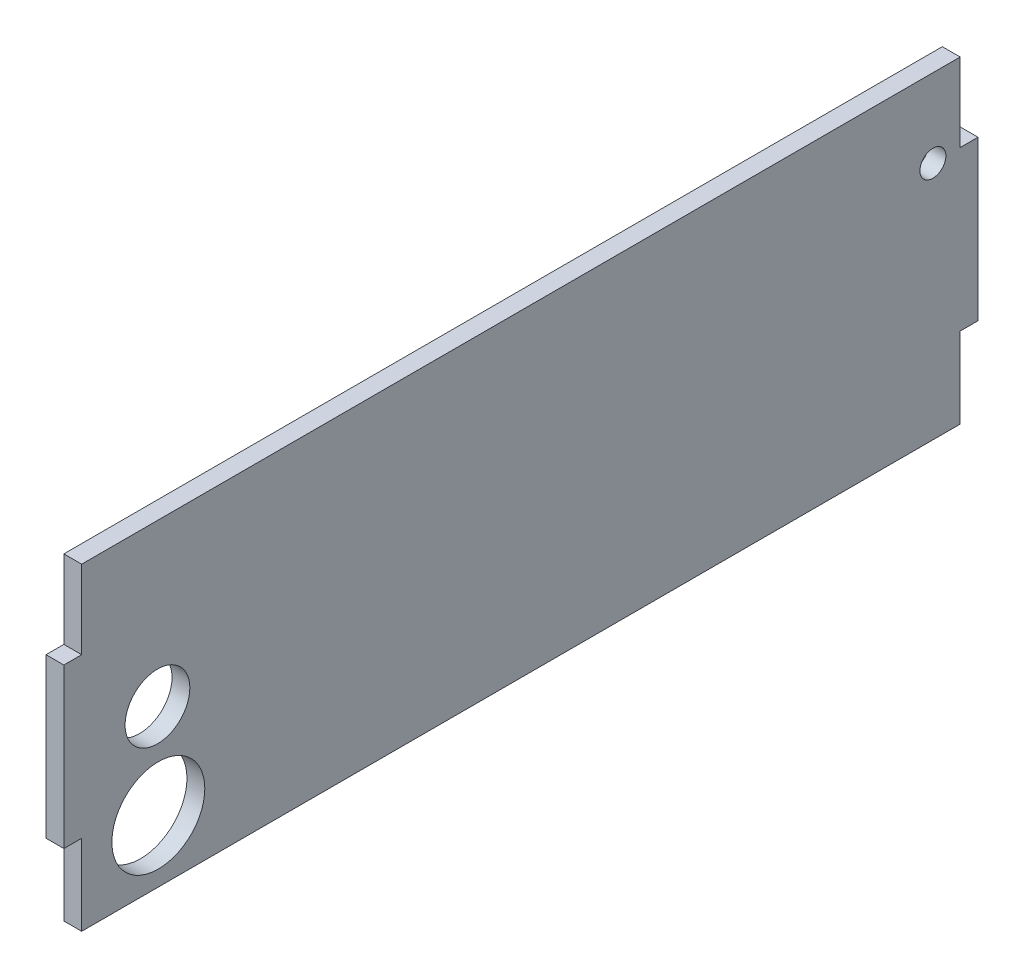
ISO-10303-21;
HEADER;
FILE_DESCRIPTION(('STEP AP214'),'2;1');
FILE_NAME('part.step','',(''),(''),'','','');
FILE_SCHEMA(('AUTOMOTIVE_DESIGN { 1 0 10303 214 1 1 1 1 }'));
ENDSEC;
DATA;
#1=APPLICATION_CONTEXT('core data for automotive mechanical design processes');
#2=APPLICATION_PROTOCOL_DEFINITION('international standard','automotive_design',2000,#1);
#3=PRODUCT_CONTEXT('',#1,'mechanical');
#4=PRODUCT('Part','Part','',(#3));
#5=PRODUCT_RELATED_PRODUCT_CATEGORY('part','',(#4));
#6=PRODUCT_DEFINITION_FORMATION('','',#4);
#7=PRODUCT_DEFINITION_CONTEXT('part definition',#1,'design');
#8=PRODUCT_DEFINITION('design','',#6,#7);
#9=PRODUCT_DEFINITION_SHAPE('','',#8);
#10=(LENGTH_UNIT() NAMED_UNIT(*) SI_UNIT(.MILLI.,.METRE.));
#11=(NAMED_UNIT(*) PLANE_ANGLE_UNIT() SI_UNIT($,.RADIAN.));
#12=(NAMED_UNIT(*) SI_UNIT($,.STERADIAN.) SOLID_ANGLE_UNIT());
#13=UNCERTAINTY_MEASURE_WITH_UNIT(LENGTH_MEASURE(1.E-05),#10,'distance_accuracy_value','');
#14=(GEOMETRIC_REPRESENTATION_CONTEXT(3) GLOBAL_UNCERTAINTY_ASSIGNED_CONTEXT((#13)) GLOBAL_UNIT_ASSIGNED_CONTEXT((#10,
#11,#12)) REPRESENTATION_CONTEXT('',''));
#15=CARTESIAN_POINT('',(0.,0.,0.));
#16=DIRECTION('',(0.,0.,1.));
#17=DIRECTION('',(1.,0.,0.));
#18=AXIS2_PLACEMENT_3D('',#15,#16,#17);
#19=CARTESIAN_POINT('',(5.7,0.,0.));
#20=DIRECTION('',(-1.,0.,0.));
#21=DIRECTION('',(0.,0.,1.));
#22=AXIS2_PLACEMENT_3D('',#19,#20,#21);
#23=PLANE('',#22);
#24=DIRECTION('',(0.,0.,1.));
#25=VECTOR('',#24,1.);
#26=CARTESIAN_POINT('',(5.7,25.75,-140.35));
#27=LINE('',#26,#25);
#28=CARTESIAN_POINT('',(5.7,25.75,-146.05));
#29=VERTEX_POINT('',#28);
#30=CARTESIAN_POINT('',(5.7,25.75,-140.35));
#31=VERTEX_POINT('',#30);
#32=EDGE_CURVE('E184',#29,#31,#27,.T.);
#33=ORIENTED_EDGE('',*,*,#32,.T.);
#34=DIRECTION('',(0.,1.,0.));
#35=VECTOR('',#34,1.);
#36=CARTESIAN_POINT('',(5.7,50.7999999999999,-140.35));
#37=LINE('',#36,#35);
#38=CARTESIAN_POINT('',(5.7,50.7999999999999,-140.35));
#39=VERTEX_POINT('',#38);
#40=EDGE_CURVE('E112',#31,#39,#37,.T.);
#41=ORIENTED_EDGE('',*,*,#40,.T.);
#42=DIRECTION('',(0.,0.,1.));
#43=VECTOR('',#42,1.);
#44=CARTESIAN_POINT('',(5.7,50.8,140.35));
#45=LINE('',#44,#43);
#46=CARTESIAN_POINT('',(5.7,50.8,140.35));
#47=VERTEX_POINT('',#46);
#48=EDGE_CURVE('E211',#39,#47,#45,.T.);
#49=ORIENTED_EDGE('',*,*,#48,.T.);
#50=DIRECTION('',(0.,-1.,0.));
#51=VECTOR('',#50,1.);
#52=CARTESIAN_POINT('',(5.7,50.8,140.35));
#53=LINE('',#52,#51);
#54=CARTESIAN_POINT('',(5.7,25.7500000000002,140.35));
#55=VERTEX_POINT('',#54);
#56=EDGE_CURVE('E230',#47,#55,#53,.T.);
#57=ORIENTED_EDGE('',*,*,#56,.T.);
#58=DIRECTION('',(0.,0.,1.));
#59=VECTOR('',#58,1.);
#60=CARTESIAN_POINT('',(5.7,25.7500000000002,140.35));
#61=LINE('',#60,#59);
#62=CARTESIAN_POINT('',(5.7,25.7500000000002,146.05));
#63=VERTEX_POINT('',#62);
#64=EDGE_CURVE('E227',#55,#63,#61,.T.);
#65=ORIENTED_EDGE('',*,*,#64,.T.);
#66=DIRECTION('',(0.,-1.,0.));
#67=VECTOR('',#66,1.);
#68=CARTESIAN_POINT('',(5.7,25.7500000000002,146.05));
#69=LINE('',#68,#67);
#70=CARTESIAN_POINT('',(5.7,-25.0499999999998,146.05));
#71=VERTEX_POINT('',#70);
#72=EDGE_CURVE('E229',#63,#71,#69,.T.);
#73=ORIENTED_EDGE('',*,*,#72,.T.);
#74=DIRECTION('',(0.,0.,-1.));
#75=VECTOR('',#74,1.);
#76=CARTESIAN_POINT('',(5.7,-25.0499999999998,146.05));
#77=LINE('',#76,#75);
#78=CARTESIAN_POINT('',(5.7,-25.0499999999998,140.35));
#79=VERTEX_POINT('',#78);
#80=EDGE_CURVE('E232',#71,#79,#77,.T.);
#81=ORIENTED_EDGE('',*,*,#80,.T.);
#82=DIRECTION('',(0.,-1.,0.));
#83=VECTOR('',#82,1.);
#84=CARTESIAN_POINT('',(5.7,-25.0499999999998,140.35));
#85=LINE('',#84,#83);
#86=CARTESIAN_POINT('',(5.7,-50.8,140.35));
#87=VERTEX_POINT('',#86);
#88=EDGE_CURVE('E238',#79,#87,#85,.T.);
#89=ORIENTED_EDGE('',*,*,#88,.T.);
#90=DIRECTION('',(0.,0.,-1.));
#91=VECTOR('',#90,1.);
#92=CARTESIAN_POINT('',(5.7,-50.8,140.35));
#93=LINE('',#92,#91);
#94=CARTESIAN_POINT('',(5.7,-50.8000000000001,-140.35));
#95=VERTEX_POINT('',#94);
#96=EDGE_CURVE('E143',#87,#95,#93,.T.);
#97=ORIENTED_EDGE('',*,*,#96,.T.);
#98=DIRECTION('',(0.,1.,0.));
#99=VECTOR('',#98,1.);
#100=CARTESIAN_POINT('',(5.7,-25.05,-140.35));
#101=LINE('',#100,#99);
#102=CARTESIAN_POINT('',(5.7,-25.05,-140.35));
#103=VERTEX_POINT('',#102);
#104=EDGE_CURVE('E137',#95,#103,#101,.T.);
#105=ORIENTED_EDGE('',*,*,#104,.T.);
#106=DIRECTION('',(0.,0.,-1.));
#107=VECTOR('',#106,1.);
#108=CARTESIAN_POINT('',(5.7,-25.05,-146.05));
#109=LINE('',#108,#107);
#110=CARTESIAN_POINT('',(5.7,-25.05,-146.05));
#111=VERTEX_POINT('',#110);
#112=EDGE_CURVE('E141',#103,#111,#109,.T.);
#113=ORIENTED_EDGE('',*,*,#112,.T.);
#114=DIRECTION('',(0.,1.,0.));
#115=VECTOR('',#114,1.);
#116=CARTESIAN_POINT('',(5.7,25.75,-146.05));
#117=LINE('',#116,#115);
#118=EDGE_CURVE('E57',#111,#29,#117,.T.);
#119=ORIENTED_EDGE('',*,*,#118,.T.);
#120=EDGE_LOOP('',(#33,#41,#49,#57,#65,#73,#81,#89,#97,#105,#113,#119));
#121=FACE_BOUND('',#120,.T.);
#122=CARTESIAN_POINT('',(5.7,25.75,-131.64243131431));
#123=DIRECTION('',(1.,0.,0.));
#124=DIRECTION('',(0.,0.,-1.));
#125=AXIS2_PLACEMENT_3D('',#122,#123,#124);
#126=CIRCLE('',#125,4.14999999999998);
#127=CARTESIAN_POINT('',(5.7,25.75,-135.79243131431));
#128=VERTEX_POINT('',#127);
#129=EDGE_CURVE('E165',#128,#128,#126,.T.);
#130=ORIENTED_EDGE('',*,*,#129,.F.);
#131=EDGE_LOOP('',(#130));
#132=FACE_BOUND('',#131,.T.);
#133=CARTESIAN_POINT('',(5.7,-0.687995650432649,116.133665793029));
#134=DIRECTION('',(1.,0.,0.));
#135=DIRECTION('',(0.,0.,-1.));
#136=AXIS2_PLACEMENT_3D('',#133,#134,#135);
#137=CIRCLE('',#136,10.3453528176941);
#138=CARTESIAN_POINT('',(5.7,-0.687995650432649,105.788312975335));
#139=VERTEX_POINT('',#138);
#140=EDGE_CURVE('E292',#139,#139,#137,.T.);
#141=ORIENTED_EDGE('',*,*,#140,.F.);
#142=EDGE_LOOP('',(#141));
#143=FACE_BOUND('',#142,.T.);
#144=CARTESIAN_POINT('',(5.7,-30.9598042694686,115.858467532856));
#145=DIRECTION('',(1.,0.,0.));
#146=DIRECTION('',(0.,0.,-1.));
#147=AXIS2_PLACEMENT_3D('',#144,#145,#146);
#148=CIRCLE('',#147,14.85);
#149=CARTESIAN_POINT('',(5.7,-30.9598042694686,101.008467532856));
#150=VERTEX_POINT('',#149);
#151=EDGE_CURVE('E283',#150,#150,#148,.T.);
#152=ORIENTED_EDGE('',*,*,#151,.F.);
#153=EDGE_LOOP('',(#152));
#154=FACE_BOUND('',#153,.T.);
#155=ADVANCED_FACE('F40',(#121,#132,#143,#154),#23,.F.);
#156=CARTESIAN_POINT('',(0.,0.,0.));
#157=DIRECTION('',(-1.,0.,0.));
#158=DIRECTION('',(0.,0.,1.));
#159=AXIS2_PLACEMENT_3D('',#156,#157,#158);
#160=PLANE('',#159);
#161=CARTESIAN_POINT('',(0.,-0.687995650432649,116.133665793029));
#162=DIRECTION('',(1.,0.,0.));
#163=DIRECTION('',(0.,0.,-1.));
#164=AXIS2_PLACEMENT_3D('',#161,#162,#163);
#165=CIRCLE('',#164,10.3453528176941);
#166=CARTESIAN_POINT('',(0.,-0.687995650432649,105.788312975335));
#167=VERTEX_POINT('',#166);
#168=EDGE_CURVE('E289',#167,#167,#165,.T.);
#169=ORIENTED_EDGE('',*,*,#168,.T.);
#170=EDGE_LOOP('',(#169));
#171=FACE_BOUND('',#170,.T.);
#172=DIRECTION('',(0.,0.,1.));
#173=VECTOR('',#172,1.);
#174=CARTESIAN_POINT('',(0.,25.75,-140.35));
#175=LINE('',#174,#173);
#176=CARTESIAN_POINT('',(0.,25.75,-146.05));
#177=VERTEX_POINT('',#176);
#178=CARTESIAN_POINT('',(0.,25.75,-140.35));
#179=VERTEX_POINT('',#178);
#180=EDGE_CURVE('E161',#177,#179,#175,.T.);
#181=ORIENTED_EDGE('',*,*,#180,.F.);
#182=DIRECTION('',(0.,1.,0.));
#183=VECTOR('',#182,1.);
#184=CARTESIAN_POINT('',(0.,25.75,-146.05));
#185=LINE('',#184,#183);
#186=CARTESIAN_POINT('',(0.,-25.05,-146.05));
#187=VERTEX_POINT('',#186);
#188=EDGE_CURVE('E104',#187,#177,#185,.T.);
#189=ORIENTED_EDGE('',*,*,#188,.F.);
#190=DIRECTION('',(0.,0.,-1.));
#191=VECTOR('',#190,1.);
#192=CARTESIAN_POINT('',(0.,-25.05,-146.05));
#193=LINE('',#192,#191);
#194=CARTESIAN_POINT('',(0.,-25.05,-140.35));
#195=VERTEX_POINT('',#194);
#196=EDGE_CURVE('E98',#195,#187,#193,.T.);
#197=ORIENTED_EDGE('',*,*,#196,.F.);
#198=DIRECTION('',(0.,1.,0.));
#199=VECTOR('',#198,1.);
#200=CARTESIAN_POINT('',(0.,-25.05,-140.35));
#201=LINE('',#200,#199);
#202=CARTESIAN_POINT('',(0.,-50.8000000000001,-140.35));
#203=VERTEX_POINT('',#202);
#204=EDGE_CURVE('E151',#203,#195,#201,.T.);
#205=ORIENTED_EDGE('',*,*,#204,.F.);
#206=DIRECTION('',(0.,0.,-1.));
#207=VECTOR('',#206,1.);
#208=CARTESIAN_POINT('',(0.,-50.8,140.35));
#209=LINE('',#208,#207);
#210=CARTESIAN_POINT('',(0.,-50.8,140.35));
#211=VERTEX_POINT('',#210);
#212=EDGE_CURVE('E179',#211,#203,#209,.T.);
#213=ORIENTED_EDGE('',*,*,#212,.F.);
#214=DIRECTION('',(0.,-1.,0.));
#215=VECTOR('',#214,1.);
#216=CARTESIAN_POINT('',(0.,-25.0499999999998,140.35));
#217=LINE('',#216,#215);
#218=CARTESIAN_POINT('',(0.,-25.0499999999998,140.35));
#219=VERTEX_POINT('',#218);
#220=EDGE_CURVE('E177',#219,#211,#217,.T.);
#221=ORIENTED_EDGE('',*,*,#220,.F.);
#222=DIRECTION('',(0.,0.,-1.));
#223=VECTOR('',#222,1.);
#224=CARTESIAN_POINT('',(0.,-25.0499999999998,146.05));
#225=LINE('',#224,#223);
#226=CARTESIAN_POINT('',(0.,-25.0499999999998,146.05));
#227=VERTEX_POINT('',#226);
#228=EDGE_CURVE('E175',#227,#219,#225,.T.);
#229=ORIENTED_EDGE('',*,*,#228,.F.);
#230=DIRECTION('',(0.,-1.,0.));
#231=VECTOR('',#230,1.);
#232=CARTESIAN_POINT('',(0.,25.7500000000002,146.05));
#233=LINE('',#232,#231);
#234=CARTESIAN_POINT('',(0.,25.7500000000002,146.05));
#235=VERTEX_POINT('',#234);
#236=EDGE_CURVE('E173',#235,#227,#233,.T.);
#237=ORIENTED_EDGE('',*,*,#236,.F.);
#238=DIRECTION('',(0.,0.,1.));
#239=VECTOR('',#238,1.);
#240=CARTESIAN_POINT('',(0.,25.7500000000002,140.35));
#241=LINE('',#240,#239);
#242=CARTESIAN_POINT('',(0.,25.7500000000002,140.35));
#243=VERTEX_POINT('',#242);
#244=EDGE_CURVE('E171',#243,#235,#241,.T.);
#245=ORIENTED_EDGE('',*,*,#244,.F.);
#246=DIRECTION('',(0.,-1.,0.));
#247=VECTOR('',#246,1.);
#248=CARTESIAN_POINT('',(0.,50.8,140.35));
#249=LINE('',#248,#247);
#250=CARTESIAN_POINT('',(0.,50.8,140.35));
#251=VERTEX_POINT('',#250);
#252=EDGE_CURVE('E169',#251,#243,#249,.T.);
#253=ORIENTED_EDGE('',*,*,#252,.F.);
#254=DIRECTION('',(0.,0.,1.));
#255=VECTOR('',#254,1.);
#256=CARTESIAN_POINT('',(0.,50.8,140.35));
#257=LINE('',#256,#255);
#258=CARTESIAN_POINT('',(0.,50.7999999999999,-140.35));
#259=VERTEX_POINT('',#258);
#260=EDGE_CURVE('E167',#259,#251,#257,.T.);
#261=ORIENTED_EDGE('',*,*,#260,.F.);
#262=DIRECTION('',(0.,1.,0.));
#263=VECTOR('',#262,1.);
#264=CARTESIAN_POINT('',(0.,50.7999999999999,-140.35));
#265=LINE('',#264,#263);
#266=EDGE_CURVE('E164',#179,#259,#265,.T.);
#267=ORIENTED_EDGE('',*,*,#266,.F.);
#268=EDGE_LOOP('',(#181,#189,#197,#205,#213,#221,#229,#237,#245,#253,#261,#267));
#269=FACE_BOUND('',#268,.T.);
#270=CARTESIAN_POINT('',(0.,25.75,-131.64243131431));
#271=DIRECTION('',(1.,0.,0.));
#272=DIRECTION('',(0.,0.,-1.));
#273=AXIS2_PLACEMENT_3D('',#270,#271,#272);
#274=CIRCLE('',#273,4.14999999999998);
#275=CARTESIAN_POINT('',(0.,25.75,-135.79243131431));
#276=VERTEX_POINT('',#275);
#277=EDGE_CURVE('E295',#276,#276,#274,.T.);
#278=ORIENTED_EDGE('',*,*,#277,.T.);
#279=EDGE_LOOP('',(#278));
#280=FACE_BOUND('',#279,.T.);
#281=CARTESIAN_POINT('',(0.,-30.9598042694686,115.858467532856));
#282=DIRECTION('',(1.,0.,0.));
#283=DIRECTION('',(0.,0.,-1.));
#284=AXIS2_PLACEMENT_3D('',#281,#282,#283);
#285=CIRCLE('',#284,14.85);
#286=CARTESIAN_POINT('',(0.,-30.9598042694686,101.008467532856));
#287=VERTEX_POINT('',#286);
#288=EDGE_CURVE('E286',#287,#287,#285,.T.);
#289=ORIENTED_EDGE('',*,*,#288,.T.);
#290=EDGE_LOOP('',(#289));
#291=FACE_BOUND('',#290,.T.);
#292=ADVANCED_FACE('F215',(#171,#269,#280,#291),#160,.T.);
#293=CARTESIAN_POINT('',(5.7,25.75,-140.35));
#294=DIRECTION('',(0.,-1.,0.));
#295=DIRECTION('',(0.,0.,-1.));
#296=AXIS2_PLACEMENT_3D('',#293,#294,#295);
#297=PLANE('',#296);
#298=ORIENTED_EDGE('',*,*,#180,.T.);
#299=DIRECTION('',(-1.,0.,0.));
#300=VECTOR('',#299,1.);
#301=CARTESIAN_POINT('',(5.7,25.75,-140.35));
#302=LINE('',#301,#300);
#303=EDGE_CURVE('E11',#31,#179,#302,.T.);
#304=ORIENTED_EDGE('',*,*,#303,.F.);
#305=ORIENTED_EDGE('',*,*,#32,.F.);
#306=DIRECTION('',(-1.,0.,0.));
#307=VECTOR('',#306,1.);
#308=CARTESIAN_POINT('',(5.7,25.75,-146.05));
#309=LINE('',#308,#307);
#310=EDGE_CURVE('E157',#29,#177,#309,.T.);
#311=ORIENTED_EDGE('',*,*,#310,.T.);
#312=EDGE_LOOP('',(#298,#304,#305,#311));
#313=FACE_BOUND('',#312,.T.);
#314=ADVANCED_FACE('F42',(#313),#297,.F.);
#315=CARTESIAN_POINT('',(5.7,50.7999999999999,-140.35));
#316=DIRECTION('',(0.,0.,1.));
#317=DIRECTION('',(1.,0.,0.));
#318=AXIS2_PLACEMENT_3D('',#315,#316,#317);
#319=PLANE('',#318);
#320=ORIENTED_EDGE('',*,*,#266,.T.);
#321=DIRECTION('',(-1.,0.,0.));
#322=VECTOR('',#321,1.);
#323=CARTESIAN_POINT('',(5.7,50.7999999999999,-140.35));
#324=LINE('',#323,#322);
#325=EDGE_CURVE('E49',#39,#259,#324,.T.);
#326=ORIENTED_EDGE('',*,*,#325,.F.);
#327=ORIENTED_EDGE('',*,*,#40,.F.);
#328=ORIENTED_EDGE('',*,*,#303,.T.);
#329=EDGE_LOOP('',(#320,#326,#327,#328));
#330=FACE_BOUND('',#329,.T.);
#331=ADVANCED_FACE('F408',(#330),#319,.F.);
#332=CARTESIAN_POINT('',(5.7,50.8,140.35));
#333=DIRECTION('',(0.,-1.,0.));
#334=DIRECTION('',(0.,0.,-1.));
#335=AXIS2_PLACEMENT_3D('',#332,#333,#334);
#336=PLANE('',#335);
#337=ORIENTED_EDGE('',*,*,#260,.T.);
#338=DIRECTION('',(-1.,0.,0.));
#339=VECTOR('',#338,1.);
#340=CARTESIAN_POINT('',(5.7,50.8,140.35));
#341=LINE('',#340,#339);
#342=EDGE_CURVE('E203',#47,#251,#341,.T.);
#343=ORIENTED_EDGE('',*,*,#342,.F.);
#344=ORIENTED_EDGE('',*,*,#48,.F.);
#345=ORIENTED_EDGE('',*,*,#325,.T.);
#346=EDGE_LOOP('',(#337,#343,#344,#345));
#347=FACE_BOUND('',#346,.T.);
#348=ADVANCED_FACE('F209',(#347),#336,.F.);
#349=CARTESIAN_POINT('',(5.7,50.8,140.35));
#350=DIRECTION('',(0.,0.,-1.));
#351=DIRECTION('',(-1.,0.,0.));
#352=AXIS2_PLACEMENT_3D('',#349,#350,#351);
#353=PLANE('',#352);
#354=ORIENTED_EDGE('',*,*,#252,.T.);
#355=DIRECTION('',(-1.,0.,0.));
#356=VECTOR('',#355,1.);
#357=CARTESIAN_POINT('',(5.7,25.7500000000002,140.35));
#358=LINE('',#357,#356);
#359=EDGE_CURVE('E200',#55,#243,#358,.T.);
#360=ORIENTED_EDGE('',*,*,#359,.F.);
#361=ORIENTED_EDGE('',*,*,#56,.F.);
#362=ORIENTED_EDGE('',*,*,#342,.T.);
#363=EDGE_LOOP('',(#354,#360,#361,#362));
#364=FACE_BOUND('',#363,.T.);
#365=ADVANCED_FACE('F221',(#364),#353,.F.);
#366=CARTESIAN_POINT('',(5.7,25.7500000000002,140.35));
#367=DIRECTION('',(0.,-1.,0.));
#368=DIRECTION('',(0.,0.,-1.));
#369=AXIS2_PLACEMENT_3D('',#366,#367,#368);
#370=PLANE('',#369);
#371=ORIENTED_EDGE('',*,*,#244,.T.);
#372=DIRECTION('',(-1.,0.,0.));
#373=VECTOR('',#372,1.);
#374=CARTESIAN_POINT('',(5.7,25.7500000000002,146.05));
#375=LINE('',#374,#373);
#376=EDGE_CURVE('E197',#63,#235,#375,.T.);
#377=ORIENTED_EDGE('',*,*,#376,.F.);
#378=ORIENTED_EDGE('',*,*,#64,.F.);
#379=ORIENTED_EDGE('',*,*,#359,.T.);
#380=EDGE_LOOP('',(#371,#377,#378,#379));
#381=FACE_BOUND('',#380,.T.);
#382=ADVANCED_FACE('F225',(#381),#370,.F.);
#383=CARTESIAN_POINT('',(5.7,25.7500000000002,146.05));
#384=DIRECTION('',(0.,0.,-1.));
#385=DIRECTION('',(0.,1.,0.));
#386=AXIS2_PLACEMENT_3D('',#383,#384,#385);
#387=PLANE('',#386);
#388=ORIENTED_EDGE('',*,*,#236,.T.);
#389=DIRECTION('',(-1.,0.,0.));
#390=VECTOR('',#389,1.);
#391=CARTESIAN_POINT('',(5.7,-25.0499999999998,146.05));
#392=LINE('',#391,#390);
#393=EDGE_CURVE('E194',#71,#227,#392,.T.);
#394=ORIENTED_EDGE('',*,*,#393,.F.);
#395=ORIENTED_EDGE('',*,*,#72,.F.);
#396=ORIENTED_EDGE('',*,*,#376,.T.);
#397=EDGE_LOOP('',(#388,#394,#395,#396));
#398=FACE_BOUND('',#397,.T.);
#399=ADVANCED_FACE('F369',(#398),#387,.F.);
#400=CARTESIAN_POINT('',(5.7,-25.0499999999998,146.05));
#401=DIRECTION('',(0.,1.,0.));
#402=DIRECTION('',(0.,0.,1.));
#403=AXIS2_PLACEMENT_3D('',#400,#401,#402);
#404=PLANE('',#403);
#405=ORIENTED_EDGE('',*,*,#228,.T.);
#406=DIRECTION('',(-1.,0.,0.));
#407=VECTOR('',#406,1.);
#408=CARTESIAN_POINT('',(5.7,-25.0499999999998,140.35));
#409=LINE('',#408,#407);
#410=EDGE_CURVE('E191',#79,#219,#409,.T.);
#411=ORIENTED_EDGE('',*,*,#410,.F.);
#412=ORIENTED_EDGE('',*,*,#80,.F.);
#413=ORIENTED_EDGE('',*,*,#393,.T.);
#414=EDGE_LOOP('',(#405,#411,#412,#413));
#415=FACE_BOUND('',#414,.T.);
#416=ADVANCED_FACE('F359',(#415),#404,.F.);
#417=CARTESIAN_POINT('',(5.7,-25.0499999999998,140.35));
#418=DIRECTION('',(0.,0.,-1.));
#419=DIRECTION('',(-1.,0.,0.));
#420=AXIS2_PLACEMENT_3D('',#417,#418,#419);
#421=PLANE('',#420);
#422=ORIENTED_EDGE('',*,*,#220,.T.);
#423=DIRECTION('',(-1.,0.,0.));
#424=VECTOR('',#423,1.);
#425=CARTESIAN_POINT('',(5.7,-50.8,140.35));
#426=LINE('',#425,#424);
#427=EDGE_CURVE('E188',#87,#211,#426,.T.);
#428=ORIENTED_EDGE('',*,*,#427,.F.);
#429=ORIENTED_EDGE('',*,*,#88,.F.);
#430=ORIENTED_EDGE('',*,*,#410,.T.);
#431=EDGE_LOOP('',(#422,#428,#429,#430));
#432=FACE_BOUND('',#431,.T.);
#433=ADVANCED_FACE('F244',(#432),#421,.F.);
#434=CARTESIAN_POINT('',(5.7,-50.8,140.35));
#435=DIRECTION('',(0.,1.,0.));
#436=DIRECTION('',(0.,0.,1.));
#437=AXIS2_PLACEMENT_3D('',#434,#435,#436);
#438=PLANE('',#437);
#439=ORIENTED_EDGE('',*,*,#212,.T.);
#440=DIRECTION('',(-1.,0.,0.));
#441=VECTOR('',#440,1.);
#442=CARTESIAN_POINT('',(5.7,-50.8000000000001,-140.35));
#443=LINE('',#442,#441);
#444=EDGE_CURVE('E152',#95,#203,#443,.T.);
#445=ORIENTED_EDGE('',*,*,#444,.F.);
#446=ORIENTED_EDGE('',*,*,#96,.F.);
#447=ORIENTED_EDGE('',*,*,#427,.T.);
#448=EDGE_LOOP('',(#439,#445,#446,#447));
#449=FACE_BOUND('',#448,.T.);
#450=ADVANCED_FACE('F248',(#449),#438,.F.);
#451=CARTESIAN_POINT('',(5.7,-25.05,-140.35));
#452=DIRECTION('',(0.,0.,1.));
#453=DIRECTION('',(1.,0.,0.));
#454=AXIS2_PLACEMENT_3D('',#451,#452,#453);
#455=PLANE('',#454);
#456=ORIENTED_EDGE('',*,*,#204,.T.);
#457=DIRECTION('',(-1.,0.,0.));
#458=VECTOR('',#457,1.);
#459=CARTESIAN_POINT('',(5.7,-25.05,-140.35));
#460=LINE('',#459,#458);
#461=EDGE_CURVE('E148',#103,#195,#460,.T.);
#462=ORIENTED_EDGE('',*,*,#461,.F.);
#463=ORIENTED_EDGE('',*,*,#104,.F.);
#464=ORIENTED_EDGE('',*,*,#444,.T.);
#465=EDGE_LOOP('',(#456,#462,#463,#464));
#466=FACE_BOUND('',#465,.T.);
#467=ADVANCED_FACE('F149',(#466),#455,.F.);
#468=CARTESIAN_POINT('',(5.7,-25.05,-146.05));
#469=DIRECTION('',(0.,1.,0.));
#470=DIRECTION('',(0.,0.,1.));
#471=AXIS2_PLACEMENT_3D('',#468,#469,#470);
#472=PLANE('',#471);
#473=ORIENTED_EDGE('',*,*,#196,.T.);
#474=DIRECTION('',(-1.,0.,0.));
#475=VECTOR('',#474,1.);
#476=CARTESIAN_POINT('',(5.7,-25.05,-146.05));
#477=LINE('',#476,#475);
#478=EDGE_CURVE('E153',#111,#187,#477,.T.);
#479=ORIENTED_EDGE('',*,*,#478,.F.);
#480=ORIENTED_EDGE('',*,*,#112,.F.);
#481=ORIENTED_EDGE('',*,*,#461,.T.);
#482=EDGE_LOOP('',(#473,#479,#480,#481));
#483=FACE_BOUND('',#482,.T.);
#484=ADVANCED_FACE('F155',(#483),#472,.F.);
#485=CARTESIAN_POINT('',(5.7,25.75,-146.05));
#486=DIRECTION('',(0.,0.,1.));
#487=DIRECTION('',(0.,-1.,0.));
#488=AXIS2_PLACEMENT_3D('',#485,#486,#487);
#489=PLANE('',#488);
#490=ORIENTED_EDGE('',*,*,#188,.T.);
#491=ORIENTED_EDGE('',*,*,#310,.F.);
#492=ORIENTED_EDGE('',*,*,#118,.F.);
#493=ORIENTED_EDGE('',*,*,#478,.T.);
#494=EDGE_LOOP('',(#490,#491,#492,#493));
#495=FACE_BOUND('',#494,.T.);
#496=ADVANCED_FACE('F252',(#495),#489,.F.);
#497=CARTESIAN_POINT('',(5.7,25.75,-131.64243131431));
#498=DIRECTION('',(-1.,0.,0.));
#499=DIRECTION('',(0.,0.,1.));
#500=AXIS2_PLACEMENT_3D('',#497,#498,#499);
#501=CYLINDRICAL_SURFACE('',#500,4.14999999999998);
#502=ORIENTED_EDGE('',*,*,#129,.T.);
#503=EDGE_LOOP('',(#502));
#504=FACE_BOUND('',#503,.T.);
#505=ORIENTED_EDGE('',*,*,#277,.F.);
#506=EDGE_LOOP('',(#505));
#507=FACE_BOUND('',#506,.T.);
#508=ADVANCED_FACE('F254',(#504,#507),#501,.F.);
#509=CARTESIAN_POINT('',(5.7,-0.687995650432649,116.133665793029));
#510=DIRECTION('',(-1.,0.,0.));
#511=DIRECTION('',(0.,0.,1.));
#512=AXIS2_PLACEMENT_3D('',#509,#510,#511);
#513=CYLINDRICAL_SURFACE('',#512,10.3453528176941);
#514=ORIENTED_EDGE('',*,*,#140,.T.);
#515=EDGE_LOOP('',(#514));
#516=FACE_BOUND('',#515,.T.);
#517=ORIENTED_EDGE('',*,*,#168,.F.);
#518=EDGE_LOOP('',(#517));
#519=FACE_BOUND('',#518,.T.);
#520=ADVANCED_FACE('F260',(#516,#519),#513,.F.);
#521=CARTESIAN_POINT('',(5.7,-30.9598042694686,115.858467532856));
#522=DIRECTION('',(-1.,0.,0.));
#523=DIRECTION('',(0.,0.,1.));
#524=AXIS2_PLACEMENT_3D('',#521,#522,#523);
#525=CYLINDRICAL_SURFACE('',#524,14.85);
#526=ORIENTED_EDGE('',*,*,#151,.T.);
#527=EDGE_LOOP('',(#526));
#528=FACE_BOUND('',#527,.T.);
#529=ORIENTED_EDGE('',*,*,#288,.F.);
#530=EDGE_LOOP('',(#529));
#531=FACE_BOUND('',#530,.T.);
#532=ADVANCED_FACE('F274',(#528,#531),#525,.F.);
#533=CLOSED_SHELL('',(#155,#292,#314,#331,#348,#365,#382,#399,#416,#433,#450,#467,#484,#496,
#508,#520,#532));
#534=MANIFOLD_SOLID_BREP('B2',#533);
#535=ADVANCED_BREP_SHAPE_REPRESENTATION('',(#18,#534),#14);
#536=SHAPE_DEFINITION_REPRESENTATION(#9,#535);
ENDSEC;
END-ISO-10303-21;
